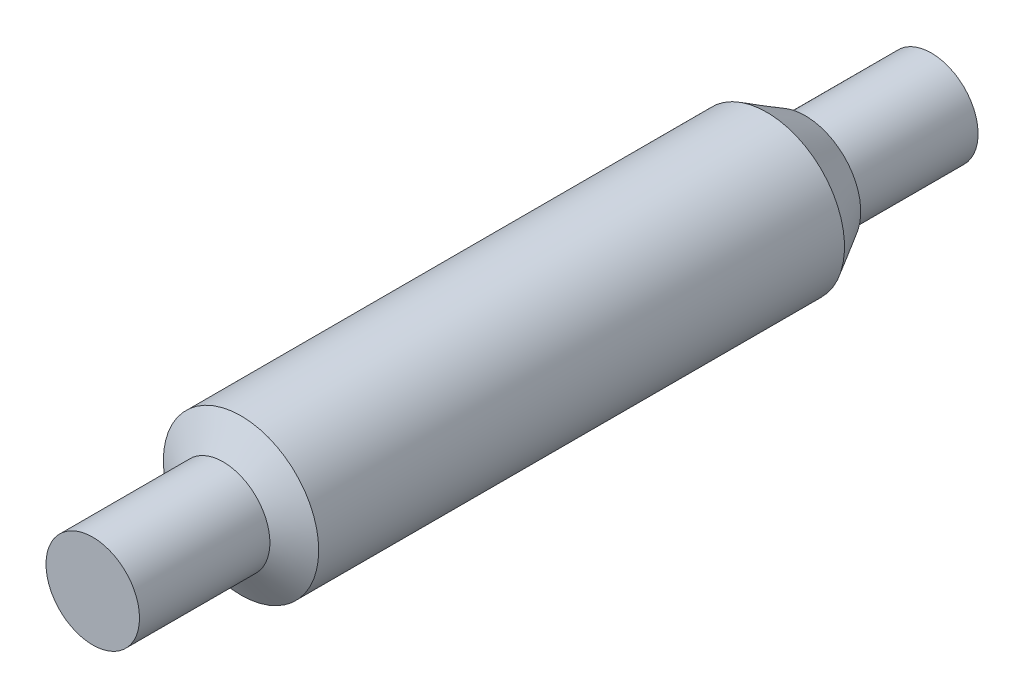
ISO-10303-21;
HEADER;
FILE_DESCRIPTION(('STEP AP214'),'2;1');
FILE_NAME('part.step','',(''),(''),'','','');
FILE_SCHEMA(('AUTOMOTIVE_DESIGN { 1 0 10303 214 1 1 1 1 }'));
ENDSEC;
DATA;
#1=APPLICATION_CONTEXT('core data for automotive mechanical design processes');
#2=APPLICATION_PROTOCOL_DEFINITION('international standard','automotive_design',2000,#1);
#3=PRODUCT_CONTEXT('',#1,'mechanical');
#4=PRODUCT('Part','Part','',(#3));
#5=PRODUCT_RELATED_PRODUCT_CATEGORY('part','',(#4));
#6=PRODUCT_DEFINITION_FORMATION('','',#4);
#7=PRODUCT_DEFINITION_CONTEXT('part definition',#1,'design');
#8=PRODUCT_DEFINITION('design','',#6,#7);
#9=PRODUCT_DEFINITION_SHAPE('','',#8);
#10=(LENGTH_UNIT() NAMED_UNIT(*) SI_UNIT(.MILLI.,.METRE.));
#11=(NAMED_UNIT(*) PLANE_ANGLE_UNIT() SI_UNIT($,.RADIAN.));
#12=(NAMED_UNIT(*) SI_UNIT($,.STERADIAN.) SOLID_ANGLE_UNIT());
#13=UNCERTAINTY_MEASURE_WITH_UNIT(LENGTH_MEASURE(1.E-05),#10,'distance_accuracy_value','');
#14=(GEOMETRIC_REPRESENTATION_CONTEXT(3) GLOBAL_UNCERTAINTY_ASSIGNED_CONTEXT((#13)) GLOBAL_UNIT_ASSIGNED_CONTEXT((#10,
#11,#12)) REPRESENTATION_CONTEXT('',''));
#15=CARTESIAN_POINT('',(0.,0.,0.));
#16=DIRECTION('',(0.,0.,1.));
#17=DIRECTION('',(1.,0.,0.));
#18=AXIS2_PLACEMENT_3D('',#15,#16,#17);
#19=CARTESIAN_POINT('',(0.,160.02,68.2020851173921));
#20=DIRECTION('',(0.,0.,-1.));
#21=DIRECTION('',(-1.,0.,0.));
#22=AXIS2_PLACEMENT_3D('',#19,#20,#21);
#23=CYLINDRICAL_SURFACE('',#22,5.34999999999999);
#24=CARTESIAN_POINT('',(0.,160.02,33.0638199529312));
#25=DIRECTION('',(0.,0.,-1.));
#26=DIRECTION('',(-1.,0.,0.));
#27=AXIS2_PLACEMENT_3D('',#24,#25,#26);
#28=CIRCLE('',#27,5.34999999999999);
#29=CARTESIAN_POINT('',(-5.34999999999999,160.02,33.0638199529312));
#30=VERTEX_POINT('',#29);
#31=EDGE_CURVE('E11',#30,#30,#28,.F.);
#32=ORIENTED_EDGE('',*,*,#31,.T.);
#33=EDGE_LOOP('',(#32));
#34=FACE_BOUND('',#33,.T.);
#35=CARTESIAN_POINT('',(0.,160.02,47.99));
#36=DIRECTION('',(0.,0.,1.));
#37=DIRECTION('',(1.,0.,0.));
#38=AXIS2_PLACEMENT_3D('',#35,#36,#37);
#39=CIRCLE('',#38,5.34999999999999);
#40=CARTESIAN_POINT('',(5.34999999999999,160.02,47.99));
#41=VERTEX_POINT('',#40);
#42=EDGE_CURVE('E53',#41,#41,#39,.T.);
#43=ORIENTED_EDGE('',*,*,#42,.F.);
#44=EDGE_LOOP('',(#43));
#45=FACE_BOUND('',#44,.T.);
#46=ADVANCED_FACE('F33',(#34,#45),#23,.T.);
#47=CARTESIAN_POINT('',(74.93,4.86640956775761,47.99));
#48=DIRECTION('',(0.,0.,1.));
#49=DIRECTION('',(1.,0.,0.));
#50=AXIS2_PLACEMENT_3D('',#47,#48,#49);
#51=PLANE('',#50);
#52=ORIENTED_EDGE('',*,*,#42,.T.);
#53=EDGE_LOOP('',(#52));
#54=FACE_BOUND('',#53,.T.);
#55=ADVANCED_FACE('F80',(#54),#51,.T.);
#56=CARTESIAN_POINT('',(-74.93,4.8664095677576,-33.56));
#57=DIRECTION('',(0.,0.,-1.));
#58=DIRECTION('',(-1.,0.,0.));
#59=AXIS2_PLACEMENT_3D('',#56,#57,#58);
#60=PLANE('',#59);
#61=CARTESIAN_POINT('',(0.,160.02,-33.56));
#62=DIRECTION('',(0.,0.,-1.));
#63=DIRECTION('',(-1.,0.,0.));
#64=AXIS2_PLACEMENT_3D('',#61,#62,#63);
#65=CIRCLE('',#64,6.34999999999997);
#66=CARTESIAN_POINT('',(-6.34999999999997,160.02,-33.56));
#67=VERTEX_POINT('',#66);
#68=EDGE_CURVE('E40',#67,#67,#65,.T.);
#69=ORIENTED_EDGE('',*,*,#68,.T.);
#70=EDGE_LOOP('',(#69));
#71=FACE_BOUND('',#70,.T.);
#72=CARTESIAN_POINT('',(0.,160.02,-33.56));
#73=DIRECTION('',(0.,0.,-1.));
#74=DIRECTION('',(-1.,0.,0.));
#75=AXIS2_PLACEMENT_3D('',#72,#73,#74);
#76=CIRCLE('',#75,5.34999999999999);
#77=CARTESIAN_POINT('',(-5.34999999999999,160.02,-33.56));
#78=VERTEX_POINT('',#77);
#79=EDGE_CURVE('E54',#78,#78,#76,.T.);
#80=ORIENTED_EDGE('',*,*,#79,.F.);
#81=EDGE_LOOP('',(#80));
#82=FACE_BOUND('',#81,.T.);
#83=ADVANCED_FACE('F76',(#71,#82),#60,.T.);
#84=CARTESIAN_POINT('',(0.,160.02,61.7047171389936));
#85=DIRECTION('',(0.,0.,-1.));
#86=DIRECTION('',(-1.,0.,0.));
#87=AXIS2_PLACEMENT_3D('',#84,#85,#86);
#88=CYLINDRICAL_SURFACE('',#87,8.89);
#89=CARTESIAN_POINT('',(0.,160.02,-29.160590948775));
#90=DIRECTION('',(0.,0.,-1.));
#91=DIRECTION('',(-1.,0.,0.));
#92=AXIS2_PLACEMENT_3D('',#89,#90,#91);
#93=CIRCLE('',#92,8.89);
#94=CARTESIAN_POINT('',(-8.89,160.02,-29.160590948775));
#95=VERTEX_POINT('',#94);
#96=EDGE_CURVE('E44',#95,#95,#93,.F.);
#97=ORIENTED_EDGE('',*,*,#96,.T.);
#98=EDGE_LOOP('',(#97));
#99=FACE_BOUND('',#98,.T.);
#100=CARTESIAN_POINT('',(0.,160.02,31.02));
#101=DIRECTION('',(0.,0.,1.));
#102=DIRECTION('',(1.,0.,0.));
#103=AXIS2_PLACEMENT_3D('',#100,#101,#102);
#104=CIRCLE('',#103,8.89);
#105=CARTESIAN_POINT('',(8.89,160.02,31.02));
#106=VERTEX_POINT('',#105);
#107=EDGE_CURVE('E48',#106,#106,#104,.F.);
#108=ORIENTED_EDGE('',*,*,#107,.T.);
#109=EDGE_LOOP('',(#108));
#110=FACE_BOUND('',#109,.T.);
#111=ADVANCED_FACE('F67',(#99,#110),#88,.T.);
#112=CARTESIAN_POINT('',(-74.93,4.8664095677576,-47.99));
#113=DIRECTION('',(0.,0.,-1.));
#114=DIRECTION('',(-1.,0.,0.));
#115=AXIS2_PLACEMENT_3D('',#112,#113,#114);
#116=PLANE('',#115);
#117=CARTESIAN_POINT('',(0.,160.02,-47.99));
#118=DIRECTION('',(0.,0.,-1.));
#119=DIRECTION('',(-1.,0.,0.));
#120=AXIS2_PLACEMENT_3D('',#117,#118,#119);
#121=CIRCLE('',#120,5.34999999999999);
#122=CARTESIAN_POINT('',(-5.34999999999999,160.02,-47.99));
#123=VERTEX_POINT('',#122);
#124=EDGE_CURVE('E57',#123,#123,#121,.F.);
#125=ORIENTED_EDGE('',*,*,#124,.F.);
#126=EDGE_LOOP('',(#125));
#127=FACE_BOUND('',#126,.T.);
#128=ADVANCED_FACE('F65',(#127),#116,.T.);
#129=ORIENTED_EDGE('',*,*,#79,.T.);
#130=EDGE_LOOP('',(#129));
#131=FACE_BOUND('',#130,.T.);
#132=ORIENTED_EDGE('',*,*,#124,.T.);
#133=EDGE_LOOP('',(#132));
#134=FACE_BOUND('',#133,.T.);
#135=ADVANCED_FACE('F63',(#131,#134),#23,.T.);
#136=CARTESIAN_POINT('',(0.,160.02,-29.160590948775));
#137=DIRECTION('',(0.,0.,1.));
#138=DIRECTION('',(1.,0.,0.));
#139=AXIS2_PLACEMENT_3D('',#136,#137,#138);
#140=CONICAL_SURFACE('',#139,8.89,0.5235987755983);
#141=ORIENTED_EDGE('',*,*,#68,.F.);
#142=EDGE_LOOP('',(#141));
#143=FACE_BOUND('',#142,.T.);
#144=ORIENTED_EDGE('',*,*,#96,.F.);
#145=EDGE_LOOP('',(#144));
#146=FACE_BOUND('',#145,.T.);
#147=ADVANCED_FACE('F73',(#143,#146),#140,.T.);
#148=CARTESIAN_POINT('',(0.,160.02,33.56));
#149=DIRECTION('',(0.,0.,-1.));
#150=DIRECTION('',(-1.,0.,0.));
#151=AXIS2_PLACEMENT_3D('',#148,#149,#150);
#152=CONICAL_SURFACE('',#151,4.49059094877496,1.0471975511966);
#153=ORIENTED_EDGE('',*,*,#107,.F.);
#154=EDGE_LOOP('',(#153));
#155=FACE_BOUND('',#154,.T.);
#156=ORIENTED_EDGE('',*,*,#31,.F.);
#157=EDGE_LOOP('',(#156));
#158=FACE_BOUND('',#157,.T.);
#159=ADVANCED_FACE('F35',(#155,#158),#152,.T.);
#160=CLOSED_SHELL('',(#46,#55,#83,#111,#128,#135,#147,#159));
#161=MANIFOLD_SOLID_BREP('B2',#160);
#162=ADVANCED_BREP_SHAPE_REPRESENTATION('',(#18,#161),#14);
#163=SHAPE_DEFINITION_REPRESENTATION(#9,#162);
ENDSEC;
END-ISO-10303-21;
